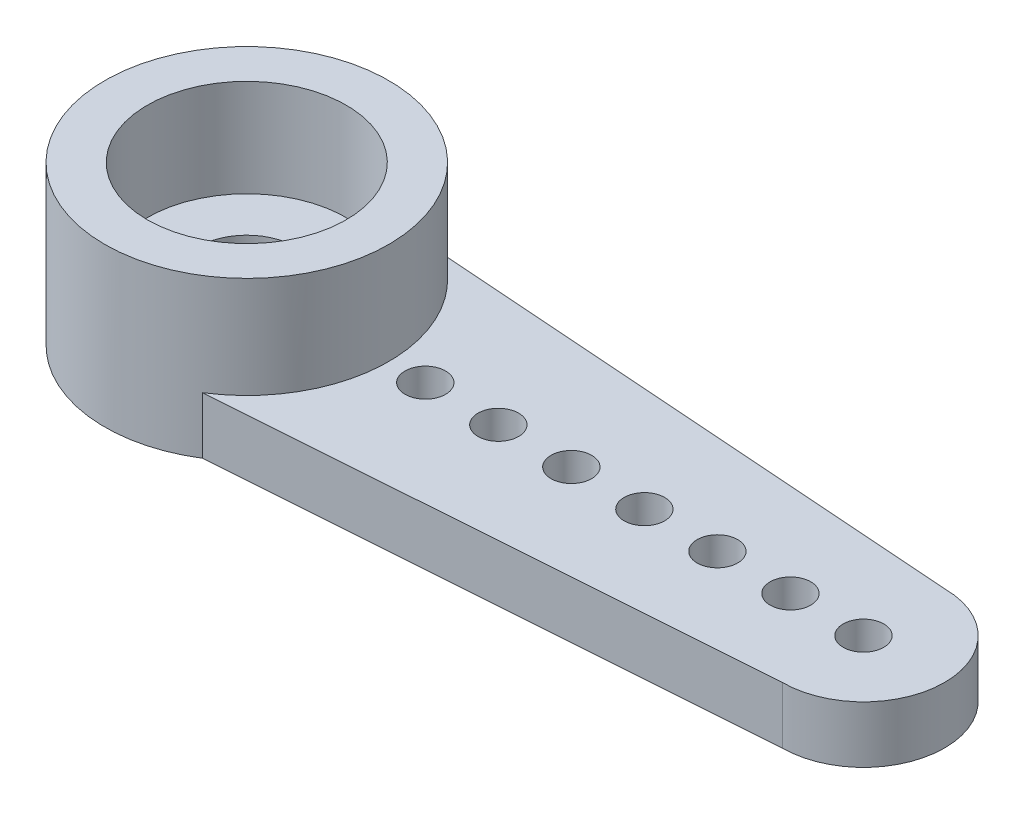
ISO-10303-21;
HEADER;
FILE_DESCRIPTION(('STEP AP214'),'2;1');
FILE_NAME('part.step','',(''),(''),'','','');
FILE_SCHEMA(('AUTOMOTIVE_DESIGN { 1 0 10303 214 1 1 1 1 }'));
ENDSEC;
DATA;
#1=APPLICATION_CONTEXT('core data for automotive mechanical design processes');
#2=APPLICATION_PROTOCOL_DEFINITION('international standard','automotive_design',2000,#1);
#3=PRODUCT_CONTEXT('',#1,'mechanical');
#4=PRODUCT('Part','Part','',(#3));
#5=PRODUCT_RELATED_PRODUCT_CATEGORY('part','',(#4));
#6=PRODUCT_DEFINITION_FORMATION('','',#4);
#7=PRODUCT_DEFINITION_CONTEXT('part definition',#1,'design');
#8=PRODUCT_DEFINITION('design','',#6,#7);
#9=PRODUCT_DEFINITION_SHAPE('','',#8);
#10=(LENGTH_UNIT() NAMED_UNIT(*) SI_UNIT(.MILLI.,.METRE.));
#11=(NAMED_UNIT(*) PLANE_ANGLE_UNIT() SI_UNIT($,.RADIAN.));
#12=(NAMED_UNIT(*) SI_UNIT($,.STERADIAN.) SOLID_ANGLE_UNIT());
#13=UNCERTAINTY_MEASURE_WITH_UNIT(LENGTH_MEASURE(1.E-05),#10,'distance_accuracy_value','');
#14=(GEOMETRIC_REPRESENTATION_CONTEXT(3) GLOBAL_UNCERTAINTY_ASSIGNED_CONTEXT((#13)) GLOBAL_UNIT_ASSIGNED_CONTEXT((#10,
#11,#12)) REPRESENTATION_CONTEXT('',''));
#15=CARTESIAN_POINT('',(0.,0.,0.));
#16=DIRECTION('',(0.,0.,1.));
#17=DIRECTION('',(1.,0.,0.));
#18=AXIS2_PLACEMENT_3D('',#15,#16,#17);
#19=CARTESIAN_POINT('',(-15.2,1.4,0.));
#20=DIRECTION('',(0.,1.,0.));
#21=DIRECTION('',(0.,0.,1.));
#22=AXIS2_PLACEMENT_3D('',#19,#20,#21);
#23=PLANE('',#22);
#24=CARTESIAN_POINT('',(6.2,1.4,0.));
#25=DIRECTION('',(0.,1.,0.));
#26=DIRECTION('',(0.,0.,1.));
#27=AXIS2_PLACEMENT_3D('',#24,#25,#26);
#28=CIRCLE('',#27,0.499999999999997);
#29=CARTESIAN_POINT('',(6.2,1.4,0.500000000000053));
#30=VERTEX_POINT('',#29);
#31=EDGE_CURVE('E132',#30,#30,#28,.T.);
#32=ORIENTED_EDGE('',*,*,#31,.F.);
#33=EDGE_LOOP('',(#32));
#34=FACE_BOUND('',#33,.T.);
#35=CARTESIAN_POINT('',(9.8,1.4,0.));
#36=DIRECTION('',(0.,1.,0.));
#37=DIRECTION('',(0.,0.,1.));
#38=AXIS2_PLACEMENT_3D('',#35,#36,#37);
#39=CIRCLE('',#38,0.499999999999997);
#40=CARTESIAN_POINT('',(9.8,1.4,0.500000000000028));
#41=VERTEX_POINT('',#40);
#42=EDGE_CURVE('E144',#41,#41,#39,.T.);
#43=ORIENTED_EDGE('',*,*,#42,.F.);
#44=EDGE_LOOP('',(#43));
#45=FACE_BOUND('',#44,.T.);
#46=CARTESIAN_POINT('',(13.4,1.4,0.));
#47=DIRECTION('',(0.,1.,0.));
#48=DIRECTION('',(0.,0.,1.));
#49=AXIS2_PLACEMENT_3D('',#46,#47,#48);
#50=CIRCLE('',#49,0.499999999999997);
#51=CARTESIAN_POINT('',(13.4,1.4,0.500000000000003));
#52=VERTEX_POINT('',#51);
#53=EDGE_CURVE('E156',#52,#52,#50,.T.);
#54=ORIENTED_EDGE('',*,*,#53,.F.);
#55=EDGE_LOOP('',(#54));
#56=FACE_BOUND('',#55,.T.);
#57=CARTESIAN_POINT('',(15.2,1.4,0.));
#58=DIRECTION('',(0.,1.,0.));
#59=DIRECTION('',(0.,0.,1.));
#60=AXIS2_PLACEMENT_3D('',#57,#58,#59);
#61=CIRCLE('',#60,0.499999999999997);
#62=CARTESIAN_POINT('',(15.2,1.4,0.49999999999999));
#63=VERTEX_POINT('',#62);
#64=EDGE_CURVE('E162',#63,#63,#61,.T.);
#65=ORIENTED_EDGE('',*,*,#64,.F.);
#66=EDGE_LOOP('',(#65));
#67=FACE_BOUND('',#66,.T.);
#68=CARTESIAN_POINT('',(11.6,1.4,0.));
#69=DIRECTION('',(0.,1.,0.));
#70=DIRECTION('',(0.,0.,1.));
#71=AXIS2_PLACEMENT_3D('',#68,#69,#70);
#72=CIRCLE('',#71,0.499999999999999);
#73=CARTESIAN_POINT('',(11.6,1.4,0.500000000000017));
#74=VERTEX_POINT('',#73);
#75=EDGE_CURVE('E150',#74,#74,#72,.T.);
#76=ORIENTED_EDGE('',*,*,#75,.F.);
#77=EDGE_LOOP('',(#76));
#78=FACE_BOUND('',#77,.T.);
#79=CARTESIAN_POINT('',(8.,1.4,0.));
#80=DIRECTION('',(0.,1.,0.));
#81=DIRECTION('',(0.,0.,1.));
#82=AXIS2_PLACEMENT_3D('',#79,#80,#81);
#83=CIRCLE('',#82,0.499999999999997);
#84=CARTESIAN_POINT('',(8.,1.4,0.500000000000041));
#85=VERTEX_POINT('',#84);
#86=EDGE_CURVE('E138',#85,#85,#83,.T.);
#87=ORIENTED_EDGE('',*,*,#86,.F.);
#88=EDGE_LOOP('',(#87));
#89=FACE_BOUND('',#88,.T.);
#90=CARTESIAN_POINT('',(4.4,1.4,0.));
#91=DIRECTION('',(0.,1.,0.));
#92=DIRECTION('',(0.,0.,1.));
#93=AXIS2_PLACEMENT_3D('',#90,#91,#92);
#94=CIRCLE('',#93,0.499999999999997);
#95=CARTESIAN_POINT('',(4.4,1.4,0.500000000000066));
#96=VERTEX_POINT('',#95);
#97=EDGE_CURVE('E126',#96,#96,#94,.T.);
#98=ORIENTED_EDGE('',*,*,#97,.F.);
#99=EDGE_LOOP('',(#98));
#100=FACE_BOUND('',#99,.T.);
#101=CARTESIAN_POINT('',(0.,1.4,0.));
#102=DIRECTION('',(0.,1.,0.));
#103=DIRECTION('',(0.,0.,1.));
#104=AXIS2_PLACEMENT_3D('',#101,#102,#103);
#105=CIRCLE('',#104,3.5);
#106=CARTESIAN_POINT('',(1.86858471289894,1.4,2.95945791838985));
#107=VERTEX_POINT('',#106);
#108=CARTESIAN_POINT('',(1.86858471289894,1.4,-2.95945791838985));
#109=VERTEX_POINT('',#108);
#110=EDGE_CURVE('E92',#107,#109,#105,.T.);
#111=ORIENTED_EDGE('',*,*,#110,.F.);
#112=DIRECTION('',(0.997420198870011,0.,-0.0717840294641297));
#113=VECTOR('',#112,1.);
#114=CARTESIAN_POINT('',(-14.9001527327747,1.4,4.16629887091939));
#115=LINE('',#114,#113);
#116=CARTESIAN_POINT('',(15.2,1.4,2.));
#117=VERTEX_POINT('',#116);
#118=EDGE_CURVE('E106',#107,#117,#115,.T.);
#119=ORIENTED_EDGE('',*,*,#118,.T.);
#120=CARTESIAN_POINT('',(15.2,1.4,0.));
#121=DIRECTION('',(0.,1.,0.));
#122=DIRECTION('',(0.,0.,-1.));
#123=AXIS2_PLACEMENT_3D('',#120,#121,#122);
#124=CIRCLE('',#123,2.);
#125=CARTESIAN_POINT('',(15.2,1.4,-2.));
#126=VERTEX_POINT('',#125);
#127=EDGE_CURVE('E168',#117,#126,#124,.T.);
#128=ORIENTED_EDGE('',*,*,#127,.T.);
#129=DIRECTION('',(-0.997420198870011,0.,-0.0717840294641295));
#130=VECTOR('',#129,1.);
#131=CARTESIAN_POINT('',(-14.9001527327747,1.4,-4.16629887091939));
#132=LINE('',#131,#130);
#133=EDGE_CURVE('E103',#126,#109,#132,.T.);
#134=ORIENTED_EDGE('',*,*,#133,.T.);
#135=EDGE_LOOP('',(#111,#119,#128,#134));
#136=FACE_BOUND('',#135,.T.);
#137=ADVANCED_FACE('F39',(#34,#45,#56,#67,#78,#89,#100,#136),#23,.T.);
#138=CARTESIAN_POINT('',(-15.2,0.,0.));
#139=DIRECTION('',(0.,1.,0.));
#140=DIRECTION('',(0.,0.,1.));
#141=AXIS2_PLACEMENT_3D('',#138,#139,#140);
#142=PLANE('',#141);
#143=CARTESIAN_POINT('',(0.,0.,0.));
#144=DIRECTION('',(0.,-1.,0.));
#145=DIRECTION('',(0.,0.,-1.));
#146=AXIS2_PLACEMENT_3D('',#143,#144,#145);
#147=CIRCLE('',#146,2.35);
#148=CARTESIAN_POINT('',(0.,0.,-2.35));
#149=VERTEX_POINT('',#148);
#150=EDGE_CURVE('E118',#149,#149,#147,.T.);
#151=ORIENTED_EDGE('',*,*,#150,.F.);
#152=EDGE_LOOP('',(#151));
#153=FACE_BOUND('',#152,.T.);
#154=CARTESIAN_POINT('',(15.2,0.,0.));
#155=DIRECTION('',(0.,1.,0.));
#156=DIRECTION('',(0.,0.,1.));
#157=AXIS2_PLACEMENT_3D('',#154,#155,#156);
#158=CIRCLE('',#157,0.499999999999997);
#159=CARTESIAN_POINT('',(15.2,0.,0.49999999999999));
#160=VERTEX_POINT('',#159);
#161=EDGE_CURVE('E159',#160,#160,#158,.T.);
#162=ORIENTED_EDGE('',*,*,#161,.T.);
#163=EDGE_LOOP('',(#162));
#164=FACE_BOUND('',#163,.T.);
#165=CARTESIAN_POINT('',(13.4,0.,0.));
#166=DIRECTION('',(0.,1.,0.));
#167=DIRECTION('',(0.,0.,1.));
#168=AXIS2_PLACEMENT_3D('',#165,#166,#167);
#169=CIRCLE('',#168,0.499999999999997);
#170=CARTESIAN_POINT('',(13.4,0.,0.500000000000003));
#171=VERTEX_POINT('',#170);
#172=EDGE_CURVE('E153',#171,#171,#169,.T.);
#173=ORIENTED_EDGE('',*,*,#172,.T.);
#174=EDGE_LOOP('',(#173));
#175=FACE_BOUND('',#174,.T.);
#176=CARTESIAN_POINT('',(11.6,0.,0.));
#177=DIRECTION('',(0.,1.,0.));
#178=DIRECTION('',(0.,0.,1.));
#179=AXIS2_PLACEMENT_3D('',#176,#177,#178);
#180=CIRCLE('',#179,0.499999999999999);
#181=CARTESIAN_POINT('',(11.6,0.,0.500000000000017));
#182=VERTEX_POINT('',#181);
#183=EDGE_CURVE('E147',#182,#182,#180,.T.);
#184=ORIENTED_EDGE('',*,*,#183,.T.);
#185=EDGE_LOOP('',(#184));
#186=FACE_BOUND('',#185,.T.);
#187=CARTESIAN_POINT('',(9.8,0.,0.));
#188=DIRECTION('',(0.,1.,0.));
#189=DIRECTION('',(0.,0.,1.));
#190=AXIS2_PLACEMENT_3D('',#187,#188,#189);
#191=CIRCLE('',#190,0.499999999999997);
#192=CARTESIAN_POINT('',(9.8,0.,0.500000000000028));
#193=VERTEX_POINT('',#192);
#194=EDGE_CURVE('E141',#193,#193,#191,.T.);
#195=ORIENTED_EDGE('',*,*,#194,.T.);
#196=EDGE_LOOP('',(#195));
#197=FACE_BOUND('',#196,.T.);
#198=CARTESIAN_POINT('',(8.,0.,0.));
#199=DIRECTION('',(0.,1.,0.));
#200=DIRECTION('',(0.,0.,1.));
#201=AXIS2_PLACEMENT_3D('',#198,#199,#200);
#202=CIRCLE('',#201,0.499999999999997);
#203=CARTESIAN_POINT('',(8.,0.,0.500000000000041));
#204=VERTEX_POINT('',#203);
#205=EDGE_CURVE('E135',#204,#204,#202,.T.);
#206=ORIENTED_EDGE('',*,*,#205,.T.);
#207=EDGE_LOOP('',(#206));
#208=FACE_BOUND('',#207,.T.);
#209=CARTESIAN_POINT('',(6.2,0.,0.));
#210=DIRECTION('',(0.,1.,0.));
#211=DIRECTION('',(0.,0.,1.));
#212=AXIS2_PLACEMENT_3D('',#209,#210,#211);
#213=CIRCLE('',#212,0.499999999999997);
#214=CARTESIAN_POINT('',(6.2,0.,0.500000000000053));
#215=VERTEX_POINT('',#214);
#216=EDGE_CURVE('E129',#215,#215,#213,.T.);
#217=ORIENTED_EDGE('',*,*,#216,.T.);
#218=EDGE_LOOP('',(#217));
#219=FACE_BOUND('',#218,.T.);
#220=CARTESIAN_POINT('',(4.4,0.,0.));
#221=DIRECTION('',(0.,1.,0.));
#222=DIRECTION('',(0.,0.,1.));
#223=AXIS2_PLACEMENT_3D('',#220,#221,#222);
#224=CIRCLE('',#223,0.499999999999997);
#225=CARTESIAN_POINT('',(4.4,0.,0.500000000000066));
#226=VERTEX_POINT('',#225);
#227=EDGE_CURVE('E123',#226,#226,#224,.T.);
#228=ORIENTED_EDGE('',*,*,#227,.T.);
#229=EDGE_LOOP('',(#228));
#230=FACE_BOUND('',#229,.T.);
#231=CARTESIAN_POINT('',(0.,0.,0.));
#232=DIRECTION('',(0.,-1.,0.));
#233=DIRECTION('',(0.,0.,-1.));
#234=AXIS2_PLACEMENT_3D('',#231,#232,#233);
#235=CIRCLE('',#234,3.5);
#236=CARTESIAN_POINT('',(1.86858471289894,0.,2.95945791838985));
#237=VERTEX_POINT('',#236);
#238=CARTESIAN_POINT('',(1.86858471289894,0.,-2.95945791838985));
#239=VERTEX_POINT('',#238);
#240=EDGE_CURVE('E77',#237,#239,#235,.T.);
#241=ORIENTED_EDGE('',*,*,#240,.T.);
#242=DIRECTION('',(0.997420198870011,0.,0.0717840294641295));
#243=VECTOR('',#242,1.);
#244=CARTESIAN_POINT('',(1.86858471289894,0.,-2.95945791838985));
#245=LINE('',#244,#243);
#246=CARTESIAN_POINT('',(15.2,0.,-2.));
#247=VERTEX_POINT('',#246);
#248=EDGE_CURVE('E82',#239,#247,#245,.T.);
#249=ORIENTED_EDGE('',*,*,#248,.T.);
#250=CARTESIAN_POINT('',(15.2,0.,0.));
#251=DIRECTION('',(0.,1.,0.));
#252=DIRECTION('',(0.,0.,-1.));
#253=AXIS2_PLACEMENT_3D('',#250,#251,#252);
#254=CIRCLE('',#253,2.);
#255=CARTESIAN_POINT('',(15.2,0.,1.99999999999999));
#256=VERTEX_POINT('',#255);
#257=EDGE_CURVE('E165',#256,#247,#254,.T.);
#258=ORIENTED_EDGE('',*,*,#257,.F.);
#259=DIRECTION('',(-0.997420198870011,0.,0.0717840294641296));
#260=VECTOR('',#259,1.);
#261=CARTESIAN_POINT('',(15.2,0.,2.));
#262=LINE('',#261,#260);
#263=EDGE_CURVE('E54',#256,#237,#262,.T.);
#264=ORIENTED_EDGE('',*,*,#263,.T.);
#265=EDGE_LOOP('',(#241,#249,#258,#264));
#266=FACE_BOUND('',#265,.T.);
#267=ADVANCED_FACE('F79',(#153,#164,#175,#186,#197,#208,#219,#230,#266),#142,.F.);
#268=CARTESIAN_POINT('',(15.2,1.4,0.));
#269=DIRECTION('',(0.,-1.,0.));
#270=DIRECTION('',(0.,0.,-1.));
#271=AXIS2_PLACEMENT_3D('',#268,#269,#270);
#272=CYLINDRICAL_SURFACE('',#271,2.);
#273=ORIENTED_EDGE('',*,*,#257,.T.);
#274=DIRECTION('',(0.,-1.,0.));
#275=VECTOR('',#274,1.);
#276=CARTESIAN_POINT('',(15.2,1.4,-2.00000000000001));
#277=LINE('',#276,#275);
#278=EDGE_CURVE('E99',#126,#247,#277,.T.);
#279=ORIENTED_EDGE('',*,*,#278,.F.);
#280=ORIENTED_EDGE('',*,*,#127,.F.);
#281=DIRECTION('',(0.,-1.,0.));
#282=VECTOR('',#281,1.);
#283=CARTESIAN_POINT('',(15.2,1.4,1.99999999999999));
#284=LINE('',#283,#282);
#285=EDGE_CURVE('E47',#117,#256,#284,.T.);
#286=ORIENTED_EDGE('',*,*,#285,.T.);
#287=EDGE_LOOP('',(#273,#279,#280,#286));
#288=FACE_BOUND('',#287,.T.);
#289=ADVANCED_FACE('F41',(#288),#272,.T.);
#290=CARTESIAN_POINT('',(15.2,1.4,0.));
#291=DIRECTION('',(0.,-1.,0.));
#292=DIRECTION('',(0.,0.,-1.));
#293=AXIS2_PLACEMENT_3D('',#290,#291,#292);
#294=CYLINDRICAL_SURFACE('',#293,0.499999999999997);
#295=ORIENTED_EDGE('',*,*,#64,.T.);
#296=EDGE_LOOP('',(#295));
#297=FACE_BOUND('',#296,.T.);
#298=ORIENTED_EDGE('',*,*,#161,.F.);
#299=EDGE_LOOP('',(#298));
#300=FACE_BOUND('',#299,.T.);
#301=ADVANCED_FACE('F227',(#297,#300),#294,.F.);
#302=CARTESIAN_POINT('',(13.4,1.4,0.));
#303=DIRECTION('',(0.,-1.,0.));
#304=DIRECTION('',(0.,0.,-1.));
#305=AXIS2_PLACEMENT_3D('',#302,#303,#304);
#306=CYLINDRICAL_SURFACE('',#305,0.499999999999997);
#307=ORIENTED_EDGE('',*,*,#53,.T.);
#308=EDGE_LOOP('',(#307));
#309=FACE_BOUND('',#308,.T.);
#310=ORIENTED_EDGE('',*,*,#172,.F.);
#311=EDGE_LOOP('',(#310));
#312=FACE_BOUND('',#311,.T.);
#313=ADVANCED_FACE('F230',(#309,#312),#306,.F.);
#314=CARTESIAN_POINT('',(11.6,1.4,0.));
#315=DIRECTION('',(0.,-1.,0.));
#316=DIRECTION('',(0.,0.,-1.));
#317=AXIS2_PLACEMENT_3D('',#314,#315,#316);
#318=CYLINDRICAL_SURFACE('',#317,0.499999999999999);
#319=ORIENTED_EDGE('',*,*,#75,.T.);
#320=EDGE_LOOP('',(#319));
#321=FACE_BOUND('',#320,.T.);
#322=ORIENTED_EDGE('',*,*,#183,.F.);
#323=EDGE_LOOP('',(#322));
#324=FACE_BOUND('',#323,.T.);
#325=ADVANCED_FACE('F234',(#321,#324),#318,.F.);
#326=CARTESIAN_POINT('',(9.8,1.4,0.));
#327=DIRECTION('',(0.,-1.,0.));
#328=DIRECTION('',(0.,0.,-1.));
#329=AXIS2_PLACEMENT_3D('',#326,#327,#328);
#330=CYLINDRICAL_SURFACE('',#329,0.499999999999997);
#331=ORIENTED_EDGE('',*,*,#42,.T.);
#332=EDGE_LOOP('',(#331));
#333=FACE_BOUND('',#332,.T.);
#334=ORIENTED_EDGE('',*,*,#194,.F.);
#335=EDGE_LOOP('',(#334));
#336=FACE_BOUND('',#335,.T.);
#337=ADVANCED_FACE('F238',(#333,#336),#330,.F.);
#338=CARTESIAN_POINT('',(8.,1.4,0.));
#339=DIRECTION('',(0.,-1.,0.));
#340=DIRECTION('',(0.,0.,-1.));
#341=AXIS2_PLACEMENT_3D('',#338,#339,#340);
#342=CYLINDRICAL_SURFACE('',#341,0.499999999999997);
#343=ORIENTED_EDGE('',*,*,#86,.T.);
#344=EDGE_LOOP('',(#343));
#345=FACE_BOUND('',#344,.T.);
#346=ORIENTED_EDGE('',*,*,#205,.F.);
#347=EDGE_LOOP('',(#346));
#348=FACE_BOUND('',#347,.T.);
#349=ADVANCED_FACE('F216',(#345,#348),#342,.F.);
#350=CARTESIAN_POINT('',(6.2,1.4,0.));
#351=DIRECTION('',(0.,-1.,0.));
#352=DIRECTION('',(0.,0.,-1.));
#353=AXIS2_PLACEMENT_3D('',#350,#351,#352);
#354=CYLINDRICAL_SURFACE('',#353,0.499999999999997);
#355=ORIENTED_EDGE('',*,*,#31,.T.);
#356=EDGE_LOOP('',(#355));
#357=FACE_BOUND('',#356,.T.);
#358=ORIENTED_EDGE('',*,*,#216,.F.);
#359=EDGE_LOOP('',(#358));
#360=FACE_BOUND('',#359,.T.);
#361=ADVANCED_FACE('F210',(#357,#360),#354,.F.);
#362=CARTESIAN_POINT('',(4.4,1.4,0.));
#363=DIRECTION('',(0.,-1.,0.));
#364=DIRECTION('',(0.,0.,-1.));
#365=AXIS2_PLACEMENT_3D('',#362,#363,#364);
#366=CYLINDRICAL_SURFACE('',#365,0.499999999999997);
#367=ORIENTED_EDGE('',*,*,#97,.T.);
#368=EDGE_LOOP('',(#367));
#369=FACE_BOUND('',#368,.T.);
#370=ORIENTED_EDGE('',*,*,#227,.F.);
#371=EDGE_LOOP('',(#370));
#372=FACE_BOUND('',#371,.T.);
#373=ADVANCED_FACE('F189',(#369,#372),#366,.F.);
#374=CARTESIAN_POINT('',(0.,1.,0.));
#375=DIRECTION('',(0.,-1.,0.));
#376=DIRECTION('',(0.,0.,-1.));
#377=AXIS2_PLACEMENT_3D('',#374,#375,#376);
#378=CYLINDRICAL_SURFACE('',#377,2.35);
#379=CARTESIAN_POINT('',(0.,1.,0.));
#380=DIRECTION('',(0.,-1.,0.));
#381=DIRECTION('',(0.,0.,-1.));
#382=AXIS2_PLACEMENT_3D('',#379,#380,#381);
#383=CIRCLE('',#382,2.35);
#384=CARTESIAN_POINT('',(0.,1.,-2.35));
#385=VERTEX_POINT('',#384);
#386=EDGE_CURVE('E120',#385,#385,#383,.T.);
#387=ORIENTED_EDGE('',*,*,#386,.F.);
#388=EDGE_LOOP('',(#387));
#389=FACE_BOUND('',#388,.T.);
#390=ORIENTED_EDGE('',*,*,#150,.T.);
#391=EDGE_LOOP('',(#390));
#392=FACE_BOUND('',#391,.T.);
#393=ADVANCED_FACE('F183',(#389,#392),#378,.F.);
#394=CARTESIAN_POINT('',(0.,1.,0.));
#395=DIRECTION('',(0.,-1.,0.));
#396=DIRECTION('',(0.,0.,-1.));
#397=AXIS2_PLACEMENT_3D('',#394,#395,#396);
#398=PLANE('',#397);
#399=CARTESIAN_POINT('',(0.,1.,0.));
#400=DIRECTION('',(0.,-1.,0.));
#401=DIRECTION('',(0.,0.,-1.));
#402=AXIS2_PLACEMENT_3D('',#399,#400,#401);
#403=CIRCLE('',#402,1.2);
#404=CARTESIAN_POINT('',(0.,1.,-1.2));
#405=VERTEX_POINT('',#404);
#406=EDGE_CURVE('E111',#405,#405,#403,.T.);
#407=ORIENTED_EDGE('',*,*,#406,.F.);
#408=EDGE_LOOP('',(#407));
#409=FACE_BOUND('',#408,.T.);
#410=ORIENTED_EDGE('',*,*,#386,.T.);
#411=EDGE_LOOP('',(#410));
#412=FACE_BOUND('',#411,.T.);
#413=ADVANCED_FACE('F179',(#409,#412),#398,.T.);
#414=CARTESIAN_POINT('',(0.,3.9,0.));
#415=DIRECTION('',(0.,1.,0.));
#416=DIRECTION('',(0.,0.,1.));
#417=AXIS2_PLACEMENT_3D('',#414,#415,#416);
#418=PLANE('',#417);
#419=CARTESIAN_POINT('',(0.,3.9,0.));
#420=DIRECTION('',(0.,1.,0.));
#421=DIRECTION('',(0.,0.,1.));
#422=AXIS2_PLACEMENT_3D('',#419,#420,#421);
#423=CIRCLE('',#422,3.5);
#424=CARTESIAN_POINT('',(0.,3.9,3.5));
#425=VERTEX_POINT('',#424);
#426=EDGE_CURVE('E115',#425,#425,#423,.T.);
#427=ORIENTED_EDGE('',*,*,#426,.T.);
#428=EDGE_LOOP('',(#427));
#429=FACE_BOUND('',#428,.T.);
#430=CARTESIAN_POINT('',(0.,3.9,0.));
#431=DIRECTION('',(0.,1.,0.));
#432=DIRECTION('',(0.,0.,1.));
#433=AXIS2_PLACEMENT_3D('',#430,#431,#432);
#434=CIRCLE('',#433,2.45);
#435=CARTESIAN_POINT('',(0.,3.9,2.45));
#436=VERTEX_POINT('',#435);
#437=EDGE_CURVE('E112',#436,#436,#434,.T.);
#438=ORIENTED_EDGE('',*,*,#437,.F.);
#439=EDGE_LOOP('',(#438));
#440=FACE_BOUND('',#439,.T.);
#441=ADVANCED_FACE('F182',(#429,#440),#418,.T.);
#442=CARTESIAN_POINT('',(0.,3.9,0.));
#443=DIRECTION('',(0.,-1.,0.));
#444=DIRECTION('',(0.,0.,-1.));
#445=AXIS2_PLACEMENT_3D('',#442,#443,#444);
#446=CYLINDRICAL_SURFACE('',#445,3.5);
#447=DIRECTION('',(0.,-1.,0.));
#448=VECTOR('',#447,1.);
#449=CARTESIAN_POINT('',(1.86858471289894,3.9,-2.95945791838985));
#450=LINE('',#449,#448);
#451=EDGE_CURVE('E86',#109,#239,#450,.T.);
#452=ORIENTED_EDGE('',*,*,#451,.T.);
#453=ORIENTED_EDGE('',*,*,#240,.F.);
#454=DIRECTION('',(0.,-1.,0.));
#455=VECTOR('',#454,1.);
#456=CARTESIAN_POINT('',(1.86858471289894,3.9,2.95945791838985));
#457=LINE('',#456,#455);
#458=EDGE_CURVE('E95',#107,#237,#457,.T.);
#459=ORIENTED_EDGE('',*,*,#458,.F.);
#460=ORIENTED_EDGE('',*,*,#110,.T.);
#461=EDGE_LOOP('',(#452,#453,#459,#460));
#462=FACE_BOUND('',#461,.T.);
#463=ORIENTED_EDGE('',*,*,#426,.F.);
#464=EDGE_LOOP('',(#463));
#465=FACE_BOUND('',#464,.T.);
#466=ADVANCED_FACE('F89',(#462,#465),#446,.T.);
#467=CARTESIAN_POINT('',(0.,3.9,0.));
#468=DIRECTION('',(0.,-1.,0.));
#469=DIRECTION('',(0.,0.,-1.));
#470=AXIS2_PLACEMENT_3D('',#467,#468,#469);
#471=CYLINDRICAL_SURFACE('',#470,2.45);
#472=CARTESIAN_POINT('',(0.,1.5,0.));
#473=DIRECTION('',(0.,1.,0.));
#474=DIRECTION('',(0.,0.,1.));
#475=AXIS2_PLACEMENT_3D('',#472,#473,#474);
#476=CIRCLE('',#475,2.45);
#477=CARTESIAN_POINT('',(0.,1.5,2.45));
#478=VERTEX_POINT('',#477);
#479=EDGE_CURVE('E11',#478,#478,#476,.T.);
#480=ORIENTED_EDGE('',*,*,#479,.F.);
#481=EDGE_LOOP('',(#480));
#482=FACE_BOUND('',#481,.T.);
#483=ORIENTED_EDGE('',*,*,#437,.T.);
#484=EDGE_LOOP('',(#483));
#485=FACE_BOUND('',#484,.T.);
#486=ADVANCED_FACE('F316',(#482,#485),#471,.F.);
#487=CARTESIAN_POINT('',(0.,0.,0.));
#488=DIRECTION('',(0.,1.,0.));
#489=DIRECTION('',(0.,0.,1.));
#490=AXIS2_PLACEMENT_3D('',#487,#488,#489);
#491=CYLINDRICAL_SURFACE('',#490,1.2);
#492=ORIENTED_EDGE('',*,*,#406,.T.);
#493=EDGE_LOOP('',(#492));
#494=FACE_BOUND('',#493,.T.);
#495=CARTESIAN_POINT('',(0.,1.5,0.));
#496=DIRECTION('',(0.,1.,0.));
#497=DIRECTION('',(0.,0.,1.));
#498=AXIS2_PLACEMENT_3D('',#495,#496,#497);
#499=CIRCLE('',#498,1.2);
#500=CARTESIAN_POINT('',(0.,1.5,1.2));
#501=VERTEX_POINT('',#500);
#502=EDGE_CURVE('E108',#501,#501,#499,.T.);
#503=ORIENTED_EDGE('',*,*,#502,.T.);
#504=EDGE_LOOP('',(#503));
#505=FACE_BOUND('',#504,.T.);
#506=ADVANCED_FACE('F176',(#494,#505),#491,.F.);
#507=CARTESIAN_POINT('',(0.,1.5,0.));
#508=DIRECTION('',(0.,1.,0.));
#509=DIRECTION('',(0.,0.,1.));
#510=AXIS2_PLACEMENT_3D('',#507,#508,#509);
#511=PLANE('',#510);
#512=ORIENTED_EDGE('',*,*,#479,.T.);
#513=EDGE_LOOP('',(#512));
#514=FACE_BOUND('',#513,.T.);
#515=ORIENTED_EDGE('',*,*,#502,.F.);
#516=EDGE_LOOP('',(#515));
#517=FACE_BOUND('',#516,.T.);
#518=ADVANCED_FACE('F334',(#514,#517),#511,.T.);
#519=CARTESIAN_POINT('',(1.86858471289894,3.9,-2.95945791838985));
#520=DIRECTION('',(0.0717840294641295,0.,-0.997420198870011));
#521=DIRECTION('',(-0.997420198870011,0.,-0.0717840294641295));
#522=AXIS2_PLACEMENT_3D('',#519,#520,#521);
#523=PLANE('',#522);
#524=ORIENTED_EDGE('',*,*,#278,.T.);
#525=ORIENTED_EDGE('',*,*,#248,.F.);
#526=ORIENTED_EDGE('',*,*,#451,.F.);
#527=ORIENTED_EDGE('',*,*,#133,.F.);
#528=EDGE_LOOP('',(#524,#525,#526,#527));
#529=FACE_BOUND('',#528,.T.);
#530=ADVANCED_FACE('F97',(#529),#523,.T.);
#531=CARTESIAN_POINT('',(15.2,3.9,2.));
#532=DIRECTION('',(0.0717840294641297,0.,0.997420198870011));
#533=DIRECTION('',(0.997420198870011,0.,-0.0717840294641297));
#534=AXIS2_PLACEMENT_3D('',#531,#532,#533);
#535=PLANE('',#534);
#536=ORIENTED_EDGE('',*,*,#458,.T.);
#537=ORIENTED_EDGE('',*,*,#263,.F.);
#538=ORIENTED_EDGE('',*,*,#285,.F.);
#539=ORIENTED_EDGE('',*,*,#118,.F.);
#540=EDGE_LOOP('',(#536,#537,#538,#539));
#541=FACE_BOUND('',#540,.T.);
#542=ADVANCED_FACE('F378',(#541),#535,.T.);
#543=CLOSED_SHELL('',(#137,#267,#289,#301,#313,#325,#337,#349,#361,#373,#393,#413,#441,#466,
#486,#506,#518,#530,#542));
#544=MANIFOLD_SOLID_BREP('B2',#543);
#545=ADVANCED_BREP_SHAPE_REPRESENTATION('',(#18,#544),#14);
#546=SHAPE_DEFINITION_REPRESENTATION(#9,#545);
ENDSEC;
END-ISO-10303-21;
